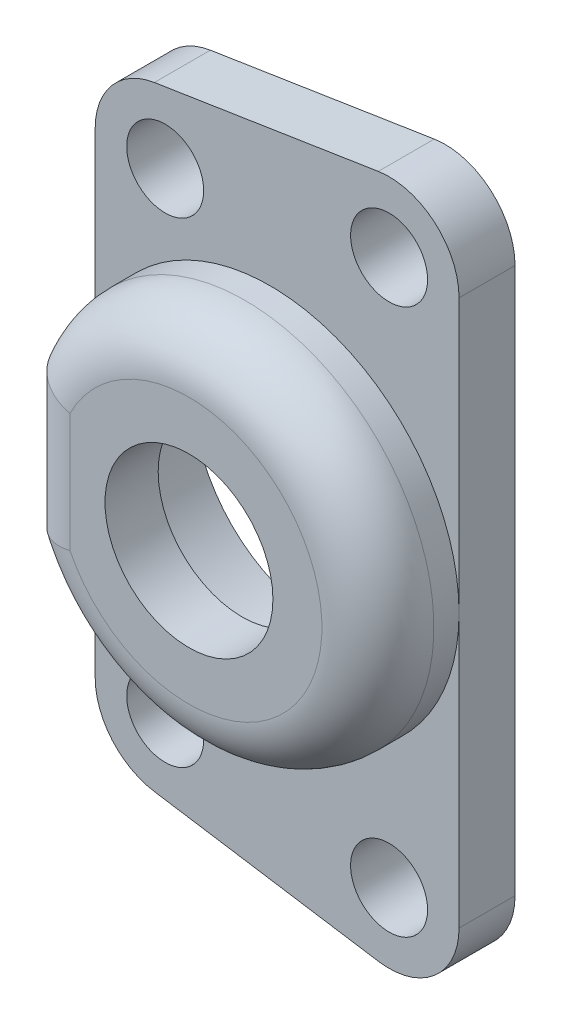
ISO-10303-21;
HEADER;
FILE_DESCRIPTION(('STEP AP214'),'2;1');
FILE_NAME('part.step','',(''),(''),'','','');
FILE_SCHEMA(('AUTOMOTIVE_DESIGN { 1 0 10303 214 1 1 1 1 }'));
ENDSEC;
DATA;
#1=APPLICATION_CONTEXT('core data for automotive mechanical design processes');
#2=APPLICATION_PROTOCOL_DEFINITION('international standard','automotive_design',2000,#1);
#3=PRODUCT_CONTEXT('',#1,'mechanical');
#4=PRODUCT('Part','Part','',(#3));
#5=PRODUCT_RELATED_PRODUCT_CATEGORY('part','',(#4));
#6=PRODUCT_DEFINITION_FORMATION('','',#4);
#7=PRODUCT_DEFINITION_CONTEXT('part definition',#1,'design');
#8=PRODUCT_DEFINITION('design','',#6,#7);
#9=PRODUCT_DEFINITION_SHAPE('','',#8);
#10=(LENGTH_UNIT() NAMED_UNIT(*) SI_UNIT(.MILLI.,.METRE.));
#11=(NAMED_UNIT(*) PLANE_ANGLE_UNIT() SI_UNIT($,.RADIAN.));
#12=(NAMED_UNIT(*) SI_UNIT($,.STERADIAN.) SOLID_ANGLE_UNIT());
#13=UNCERTAINTY_MEASURE_WITH_UNIT(LENGTH_MEASURE(1.E-05),#10,'distance_accuracy_value','');
#14=(GEOMETRIC_REPRESENTATION_CONTEXT(3) GLOBAL_UNCERTAINTY_ASSIGNED_CONTEXT((#13)) GLOBAL_UNIT_ASSIGNED_CONTEXT((#10,
#11,#12)) REPRESENTATION_CONTEXT('',''));
#15=CARTESIAN_POINT('',(0.,0.,0.));
#16=DIRECTION('',(0.,0.,1.));
#17=DIRECTION('',(1.,0.,0.));
#18=AXIS2_PLACEMENT_3D('',#15,#16,#17);
#19=CARTESIAN_POINT('',(7.50000000000001,17.,0.));
#20=DIRECTION('',(0.,0.,1.));
#21=DIRECTION('',(1.,0.,0.));
#22=AXIS2_PLACEMENT_3D('',#19,#20,#21);
#23=CYLINDRICAL_SURFACE('',#22,6.);
#24=CARTESIAN_POINT('',(7.50000000000001,17.,9.8));
#25=DIRECTION('',(0.,0.,1.));
#26=DIRECTION('',(1.,0.,0.));
#27=AXIS2_PLACEMENT_3D('',#24,#25,#26);
#28=CIRCLE('',#27,6.);
#29=CARTESIAN_POINT('',(13.5,17.,9.8));
#30=VERTEX_POINT('',#29);
#31=EDGE_CURVE('E181',#30,#30,#28,.T.);
#32=ORIENTED_EDGE('',*,*,#31,.T.);
#33=EDGE_LOOP('',(#32));
#34=FACE_BOUND('',#33,.T.);
#35=CARTESIAN_POINT('',(7.50000000000001,17.,6.));
#36=DIRECTION('',(0.,0.,-1.));
#37=DIRECTION('',(-1.,0.,0.));
#38=AXIS2_PLACEMENT_3D('',#35,#36,#37);
#39=CIRCLE('',#38,6.);
#40=CARTESIAN_POINT('',(1.5,17.,6.));
#41=VERTEX_POINT('',#40);
#42=EDGE_CURVE('E37',#41,#41,#39,.F.);
#43=ORIENTED_EDGE('',*,*,#42,.F.);
#44=EDGE_LOOP('',(#43));
#45=FACE_BOUND('',#44,.T.);
#46=ADVANCED_FACE('F33',(#34,#45),#23,.F.);
#47=CARTESIAN_POINT('',(16.,36.5,4.));
#48=DIRECTION('',(0.,0.,-1.));
#49=DIRECTION('',(-1.,0.,0.));
#50=AXIS2_PLACEMENT_3D('',#47,#48,#49);
#51=PLANE('',#50);
#52=CARTESIAN_POINT('',(0.,0.,4.));
#53=DIRECTION('',(0.,0.,1.));
#54=DIRECTION('',(1.,0.,0.));
#55=AXIS2_PLACEMENT_3D('',#52,#53,#54);
#56=CIRCLE('',#55,2.75);
#57=CARTESIAN_POINT('',(2.75000000000001,0.,4.));
#58=VERTEX_POINT('',#57);
#59=EDGE_CURVE('E240',#58,#58,#56,.T.);
#60=ORIENTED_EDGE('',*,*,#59,.F.);
#61=EDGE_LOOP('',(#60));
#62=FACE_BOUND('',#61,.T.);
#63=CARTESIAN_POINT('',(16.,-2.5,4.));
#64=DIRECTION('',(0.,0.,1.));
#65=DIRECTION('',(1.,0.,0.));
#66=AXIS2_PLACEMENT_3D('',#63,#64,#65);
#67=CIRCLE('',#66,2.75);
#68=CARTESIAN_POINT('',(18.75,-2.5,4.));
#69=VERTEX_POINT('',#68);
#70=EDGE_CURVE('E234',#69,#69,#67,.T.);
#71=ORIENTED_EDGE('',*,*,#70,.F.);
#72=EDGE_LOOP('',(#71));
#73=FACE_BOUND('',#72,.T.);
#74=CARTESIAN_POINT('',(7.50000000000001,17.,4.));
#75=DIRECTION('',(0.,0.,1.));
#76=DIRECTION('',(1.,0.,0.));
#77=AXIS2_PLACEMENT_3D('',#74,#75,#76);
#78=CIRCLE('',#77,13.5);
#79=CARTESIAN_POINT('',(-5.,11.9009804864072,4.));
#80=VERTEX_POINT('',#79);
#81=CARTESIAN_POINT('',(21.,17.,4.));
#82=VERTEX_POINT('',#81);
#83=EDGE_CURVE('E142',#80,#82,#78,.T.);
#84=ORIENTED_EDGE('',*,*,#83,.F.);
#85=DIRECTION('',(0.,-1.,0.));
#86=VECTOR('',#85,1.);
#87=CARTESIAN_POINT('',(-5.,0.,4.));
#88=LINE('',#87,#86);
#89=CARTESIAN_POINT('',(-5.,0.,4.));
#90=VERTEX_POINT('',#89);
#91=EDGE_CURVE('E137',#80,#90,#88,.T.);
#92=ORIENTED_EDGE('',*,*,#91,.T.);
#93=CARTESIAN_POINT('',(0.,0.,4.));
#94=DIRECTION('',(0.,0.,1.));
#95=DIRECTION('',(-1.,0.,0.));
#96=AXIS2_PLACEMENT_3D('',#93,#94,#95);
#97=CIRCLE('',#96,5.);
#98=CARTESIAN_POINT('',(-0.77188440136804,-4.94006016875551,4.));
#99=VERTEX_POINT('',#98);
#100=EDGE_CURVE('E136',#90,#99,#97,.T.);
#101=ORIENTED_EDGE('',*,*,#100,.T.);
#102=DIRECTION('',(0.988012033751101,-0.15437688027361,0.));
#103=VECTOR('',#102,1.);
#104=CARTESIAN_POINT('',(15.2281155986319,-7.4400601687555,4.));
#105=LINE('',#104,#103);
#106=CARTESIAN_POINT('',(15.2281155986319,-7.4400601687555,4.));
#107=VERTEX_POINT('',#106);
#108=EDGE_CURVE('E286',#99,#107,#105,.T.);
#109=ORIENTED_EDGE('',*,*,#108,.T.);
#110=CARTESIAN_POINT('',(16.,-2.5,4.));
#111=DIRECTION('',(0.,0.,1.));
#112=DIRECTION('',(-1.,0.,0.));
#113=AXIS2_PLACEMENT_3D('',#110,#111,#112);
#114=CIRCLE('',#113,5.);
#115=CARTESIAN_POINT('',(21.,-2.5,4.));
#116=VERTEX_POINT('',#115);
#117=EDGE_CURVE('E285',#107,#116,#114,.T.);
#118=ORIENTED_EDGE('',*,*,#117,.T.);
#119=DIRECTION('',(0.,1.,0.));
#120=VECTOR('',#119,1.);
#121=CARTESIAN_POINT('',(21.,36.5,4.));
#122=LINE('',#121,#120);
#123=EDGE_CURVE('E252',#116,#82,#122,.T.);
#124=ORIENTED_EDGE('',*,*,#123,.T.);
#125=EDGE_LOOP('',(#84,#92,#101,#109,#118,#124));
#126=FACE_BOUND('',#125,.T.);
#127=ADVANCED_FACE('F193',(#62,#73,#126),#51,.F.);
#128=CARTESIAN_POINT('',(16.,36.5,4.));
#129=DIRECTION('',(0.,0.,1.));
#130=DIRECTION('',(1.,0.,0.));
#131=AXIS2_PLACEMENT_3D('',#128,#129,#130);
#132=CIRCLE('',#131,2.75);
#133=CARTESIAN_POINT('',(18.75,36.5,4.));
#134=VERTEX_POINT('',#133);
#135=EDGE_CURVE('E228',#134,#134,#132,.T.);
#136=ORIENTED_EDGE('',*,*,#135,.F.);
#137=EDGE_LOOP('',(#136));
#138=FACE_BOUND('',#137,.T.);
#139=CARTESIAN_POINT('',(0.,34.,4.));
#140=DIRECTION('',(0.,0.,1.));
#141=DIRECTION('',(1.,0.,0.));
#142=AXIS2_PLACEMENT_3D('',#139,#140,#141);
#143=CIRCLE('',#142,2.75);
#144=CARTESIAN_POINT('',(2.75000000000001,34.,4.));
#145=VERTEX_POINT('',#144);
#146=EDGE_CURVE('E222',#145,#145,#143,.T.);
#147=ORIENTED_EDGE('',*,*,#146,.F.);
#148=EDGE_LOOP('',(#147));
#149=FACE_BOUND('',#148,.T.);
#150=CARTESIAN_POINT('',(-4.99999999999998,22.0990195135928,4.));
#151=VERTEX_POINT('',#150);
#152=EDGE_CURVE('E131',#82,#151,#78,.T.);
#153=ORIENTED_EDGE('',*,*,#152,.F.);
#154=CARTESIAN_POINT('',(21.,36.5,4.));
#155=VERTEX_POINT('',#154);
#156=EDGE_CURVE('E284',#82,#155,#122,.T.);
#157=ORIENTED_EDGE('',*,*,#156,.T.);
#158=CARTESIAN_POINT('',(16.,36.5,4.));
#159=DIRECTION('',(0.,0.,1.));
#160=DIRECTION('',(-1.,0.,0.));
#161=AXIS2_PLACEMENT_3D('',#158,#159,#160);
#162=CIRCLE('',#161,4.99999999999999);
#163=CARTESIAN_POINT('',(15.2281155986319,41.4400601687555,4.));
#164=VERTEX_POINT('',#163);
#165=EDGE_CURVE('E258',#155,#164,#162,.T.);
#166=ORIENTED_EDGE('',*,*,#165,.T.);
#167=DIRECTION('',(-0.988012033751101,-0.15437688027361,0.));
#168=VECTOR('',#167,1.);
#169=CARTESIAN_POINT('',(-0.771884401368045,38.9400601687555,4.));
#170=LINE('',#169,#168);
#171=CARTESIAN_POINT('',(-0.771884401368045,38.9400601687555,4.));
#172=VERTEX_POINT('',#171);
#173=EDGE_CURVE('E256',#164,#172,#170,.T.);
#174=ORIENTED_EDGE('',*,*,#173,.T.);
#175=CARTESIAN_POINT('',(0.,34.,4.));
#176=DIRECTION('',(0.,0.,1.));
#177=DIRECTION('',(-1.,0.,0.));
#178=AXIS2_PLACEMENT_3D('',#175,#176,#177);
#179=CIRCLE('',#178,5.);
#180=CARTESIAN_POINT('',(-5.,34.,4.));
#181=VERTEX_POINT('',#180);
#182=EDGE_CURVE('E134',#172,#181,#179,.T.);
#183=ORIENTED_EDGE('',*,*,#182,.T.);
#184=EDGE_CURVE('E122',#181,#151,#88,.T.);
#185=ORIENTED_EDGE('',*,*,#184,.T.);
#186=EDGE_LOOP('',(#153,#157,#166,#174,#183,#185));
#187=FACE_BOUND('',#186,.T.);
#188=ADVANCED_FACE('F130',(#138,#149,#187),#51,.F.);
#189=CARTESIAN_POINT('',(16.,36.5,4.));
#190=DIRECTION('',(0.,0.,-1.));
#191=DIRECTION('',(-1.,0.,0.));
#192=AXIS2_PLACEMENT_3D('',#189,#190,#191);
#193=CYLINDRICAL_SURFACE('',#192,4.99999999999999);
#194=CARTESIAN_POINT('',(16.,36.5,0.));
#195=DIRECTION('',(0.,0.,1.));
#196=DIRECTION('',(-1.,0.,0.));
#197=AXIS2_PLACEMENT_3D('',#194,#195,#196);
#198=CIRCLE('',#197,4.99999999999999);
#199=CARTESIAN_POINT('',(21.,36.5,0.));
#200=VERTEX_POINT('',#199);
#201=CARTESIAN_POINT('',(15.2281155986319,41.4400601687555,0.));
#202=VERTEX_POINT('',#201);
#203=EDGE_CURVE('E126',#200,#202,#198,.T.);
#204=ORIENTED_EDGE('',*,*,#203,.T.);
#205=DIRECTION('',(0.,0.,-1.));
#206=VECTOR('',#205,1.);
#207=CARTESIAN_POINT('',(15.2281155986319,41.4400601687555,4.));
#208=LINE('',#207,#206);
#209=EDGE_CURVE('E144',#164,#202,#208,.T.);
#210=ORIENTED_EDGE('',*,*,#209,.F.);
#211=ORIENTED_EDGE('',*,*,#165,.F.);
#212=DIRECTION('',(0.,0.,-1.));
#213=VECTOR('',#212,1.);
#214=CARTESIAN_POINT('',(21.,36.5,4.));
#215=LINE('',#214,#213);
#216=EDGE_CURVE('E280',#155,#200,#215,.T.);
#217=ORIENTED_EDGE('',*,*,#216,.T.);
#218=EDGE_LOOP('',(#204,#210,#211,#217));
#219=FACE_BOUND('',#218,.T.);
#220=ADVANCED_FACE('F35',(#219),#193,.T.);
#221=CARTESIAN_POINT('',(-0.771884401368045,38.9400601687555,4.));
#222=DIRECTION('',(0.15437688027361,-0.988012033751101,0.));
#223=DIRECTION('',(0.988012033751101,0.15437688027361,0.));
#224=AXIS2_PLACEMENT_3D('',#221,#222,#223);
#225=PLANE('',#224);
#226=DIRECTION('',(-0.988012033751101,-0.15437688027361,0.));
#227=VECTOR('',#226,1.);
#228=CARTESIAN_POINT('',(-0.771884401368045,38.9400601687555,0.));
#229=LINE('',#228,#227);
#230=CARTESIAN_POINT('',(-0.771884401368045,38.9400601687555,0.));
#231=VERTEX_POINT('',#230);
#232=EDGE_CURVE('E318',#202,#231,#229,.T.);
#233=ORIENTED_EDGE('',*,*,#232,.T.);
#234=DIRECTION('',(0.,0.,-1.));
#235=VECTOR('',#234,1.);
#236=CARTESIAN_POINT('',(-0.771884401368045,38.9400601687555,4.));
#237=LINE('',#236,#235);
#238=EDGE_CURVE('E149',#172,#231,#237,.T.);
#239=ORIENTED_EDGE('',*,*,#238,.F.);
#240=ORIENTED_EDGE('',*,*,#173,.F.);
#241=ORIENTED_EDGE('',*,*,#209,.T.);
#242=EDGE_LOOP('',(#233,#239,#240,#241));
#243=FACE_BOUND('',#242,.T.);
#244=ADVANCED_FACE('F317',(#243),#225,.F.);
#245=CARTESIAN_POINT('',(0.,34.,4.));
#246=DIRECTION('',(0.,0.,-1.));
#247=DIRECTION('',(-1.,0.,0.));
#248=AXIS2_PLACEMENT_3D('',#245,#246,#247);
#249=CYLINDRICAL_SURFACE('',#248,5.);
#250=CARTESIAN_POINT('',(0.,34.,0.));
#251=DIRECTION('',(0.,0.,1.));
#252=DIRECTION('',(-1.,0.,0.));
#253=AXIS2_PLACEMENT_3D('',#250,#251,#252);
#254=CIRCLE('',#253,5.);
#255=CARTESIAN_POINT('',(-5.,34.,0.));
#256=VERTEX_POINT('',#255);
#257=EDGE_CURVE('E322',#231,#256,#254,.T.);
#258=ORIENTED_EDGE('',*,*,#257,.T.);
#259=DIRECTION('',(0.,0.,-1.));
#260=VECTOR('',#259,1.);
#261=CARTESIAN_POINT('',(-5.,34.,4.));
#262=LINE('',#261,#260);
#263=EDGE_CURVE('E268',#181,#256,#262,.T.);
#264=ORIENTED_EDGE('',*,*,#263,.F.);
#265=ORIENTED_EDGE('',*,*,#182,.F.);
#266=ORIENTED_EDGE('',*,*,#238,.T.);
#267=EDGE_LOOP('',(#258,#264,#265,#266));
#268=FACE_BOUND('',#267,.T.);
#269=ADVANCED_FACE('F321',(#268),#249,.T.);
#270=CARTESIAN_POINT('',(-5.,0.,4.));
#271=DIRECTION('',(1.,0.,0.));
#272=DIRECTION('',(0.,0.,-1.));
#273=AXIS2_PLACEMENT_3D('',#270,#271,#272);
#274=PLANE('',#273);
#275=DIRECTION('',(0.,0.,-1.));
#276=VECTOR('',#275,1.);
#277=CARTESIAN_POINT('',(-4.99999999999998,11.9009804864072,9.8));
#278=LINE('',#277,#276);
#279=CARTESIAN_POINT('',(-4.99999999999998,11.9009804864072,5.8));
#280=VERTEX_POINT('',#279);
#281=EDGE_CURVE('E127',#280,#80,#278,.T.);
#282=ORIENTED_EDGE('',*,*,#281,.F.);
#283=DIRECTION('',(0.,-1.,0.));
#284=VECTOR('',#283,1.);
#285=CARTESIAN_POINT('',(-5.,22.0990195135928,5.8));
#286=LINE('',#285,#284);
#287=CARTESIAN_POINT('',(-4.99999999999998,22.0990195135928,5.8));
#288=VERTEX_POINT('',#287);
#289=EDGE_CURVE('E11',#280,#288,#286,.F.);
#290=ORIENTED_EDGE('',*,*,#289,.T.);
#291=DIRECTION('',(0.,0.,-1.));
#292=VECTOR('',#291,1.);
#293=CARTESIAN_POINT('',(-4.99999999999998,22.0990195135928,9.8));
#294=LINE('',#293,#292);
#295=EDGE_CURVE('E118',#288,#151,#294,.T.);
#296=ORIENTED_EDGE('',*,*,#295,.T.);
#297=ORIENTED_EDGE('',*,*,#184,.F.);
#298=ORIENTED_EDGE('',*,*,#263,.T.);
#299=DIRECTION('',(0.,-1.,0.));
#300=VECTOR('',#299,1.);
#301=CARTESIAN_POINT('',(-5.,0.,0.));
#302=LINE('',#301,#300);
#303=CARTESIAN_POINT('',(-5.,0.,0.));
#304=VERTEX_POINT('',#303);
#305=EDGE_CURVE('E324',#256,#304,#302,.T.);
#306=ORIENTED_EDGE('',*,*,#305,.T.);
#307=DIRECTION('',(0.,0.,-1.));
#308=VECTOR('',#307,1.);
#309=CARTESIAN_POINT('',(-5.,0.,4.));
#310=LINE('',#309,#308);
#311=EDGE_CURVE('E254',#90,#304,#310,.T.);
#312=ORIENTED_EDGE('',*,*,#311,.F.);
#313=ORIENTED_EDGE('',*,*,#91,.F.);
#314=EDGE_LOOP('',(#282,#290,#296,#297,#298,#306,#312,#313));
#315=FACE_BOUND('',#314,.T.);
#316=ADVANCED_FACE('F120',(#315),#274,.F.);
#317=CARTESIAN_POINT('',(0.,0.,4.));
#318=DIRECTION('',(0.,0.,-1.));
#319=DIRECTION('',(-1.,0.,0.));
#320=AXIS2_PLACEMENT_3D('',#317,#318,#319);
#321=CYLINDRICAL_SURFACE('',#320,5.);
#322=CARTESIAN_POINT('',(0.,0.,0.));
#323=DIRECTION('',(0.,0.,1.));
#324=DIRECTION('',(-1.,0.,0.));
#325=AXIS2_PLACEMENT_3D('',#322,#323,#324);
#326=CIRCLE('',#325,5.);
#327=CARTESIAN_POINT('',(-0.77188440136804,-4.94006016875551,0.));
#328=VERTEX_POINT('',#327);
#329=EDGE_CURVE('E293',#304,#328,#326,.T.);
#330=ORIENTED_EDGE('',*,*,#329,.T.);
#331=DIRECTION('',(0.,0.,-1.));
#332=VECTOR('',#331,1.);
#333=CARTESIAN_POINT('',(-0.77188440136804,-4.94006016875551,4.));
#334=LINE('',#333,#332);
#335=EDGE_CURVE('E271',#99,#328,#334,.T.);
#336=ORIENTED_EDGE('',*,*,#335,.F.);
#337=ORIENTED_EDGE('',*,*,#100,.F.);
#338=ORIENTED_EDGE('',*,*,#311,.T.);
#339=EDGE_LOOP('',(#330,#336,#337,#338));
#340=FACE_BOUND('',#339,.T.);
#341=ADVANCED_FACE('F291',(#340),#321,.T.);
#342=CARTESIAN_POINT('',(15.2281155986319,-7.4400601687555,4.));
#343=DIRECTION('',(0.15437688027361,0.988012033751101,0.));
#344=DIRECTION('',(-0.988012033751101,0.15437688027361,0.));
#345=AXIS2_PLACEMENT_3D('',#342,#343,#344);
#346=PLANE('',#345);
#347=DIRECTION('',(0.988012033751101,-0.15437688027361,0.));
#348=VECTOR('',#347,1.);
#349=CARTESIAN_POINT('',(15.2281155986319,-7.4400601687555,0.));
#350=LINE('',#349,#348);
#351=CARTESIAN_POINT('',(15.2281155986319,-7.4400601687555,0.));
#352=VERTEX_POINT('',#351);
#353=EDGE_CURVE('E298',#328,#352,#350,.T.);
#354=ORIENTED_EDGE('',*,*,#353,.T.);
#355=DIRECTION('',(0.,0.,-1.));
#356=VECTOR('',#355,1.);
#357=CARTESIAN_POINT('',(15.2281155986319,-7.4400601687555,4.));
#358=LINE('',#357,#356);
#359=EDGE_CURVE('E274',#107,#352,#358,.T.);
#360=ORIENTED_EDGE('',*,*,#359,.F.);
#361=ORIENTED_EDGE('',*,*,#108,.F.);
#362=ORIENTED_EDGE('',*,*,#335,.T.);
#363=EDGE_LOOP('',(#354,#360,#361,#362));
#364=FACE_BOUND('',#363,.T.);
#365=ADVANCED_FACE('F296',(#364),#346,.F.);
#366=CARTESIAN_POINT('',(16.,-2.5,4.));
#367=DIRECTION('',(0.,0.,-1.));
#368=DIRECTION('',(-1.,0.,0.));
#369=AXIS2_PLACEMENT_3D('',#366,#367,#368);
#370=CYLINDRICAL_SURFACE('',#369,5.);
#371=CARTESIAN_POINT('',(16.,-2.5,0.));
#372=DIRECTION('',(0.,0.,1.));
#373=DIRECTION('',(-1.,0.,0.));
#374=AXIS2_PLACEMENT_3D('',#371,#372,#373);
#375=CIRCLE('',#374,5.);
#376=CARTESIAN_POINT('',(21.,-2.5,0.));
#377=VERTEX_POINT('',#376);
#378=EDGE_CURVE('E303',#352,#377,#375,.T.);
#379=ORIENTED_EDGE('',*,*,#378,.T.);
#380=DIRECTION('',(0.,0.,-1.));
#381=VECTOR('',#380,1.);
#382=CARTESIAN_POINT('',(21.,-2.5,4.));
#383=LINE('',#382,#381);
#384=EDGE_CURVE('E277',#116,#377,#383,.T.);
#385=ORIENTED_EDGE('',*,*,#384,.F.);
#386=ORIENTED_EDGE('',*,*,#117,.F.);
#387=ORIENTED_EDGE('',*,*,#359,.T.);
#388=EDGE_LOOP('',(#379,#385,#386,#387));
#389=FACE_BOUND('',#388,.T.);
#390=ADVANCED_FACE('F302',(#389),#370,.T.);
#391=CARTESIAN_POINT('',(21.,36.5,4.));
#392=DIRECTION('',(-1.,0.,0.));
#393=DIRECTION('',(0.,0.,1.));
#394=AXIS2_PLACEMENT_3D('',#391,#392,#393);
#395=PLANE('',#394);
#396=DIRECTION('',(0.,1.,0.));
#397=VECTOR('',#396,1.);
#398=CARTESIAN_POINT('',(21.,36.5,0.));
#399=LINE('',#398,#397);
#400=EDGE_CURVE('E313',#377,#200,#399,.T.);
#401=ORIENTED_EDGE('',*,*,#400,.T.);
#402=ORIENTED_EDGE('',*,*,#216,.F.);
#403=ORIENTED_EDGE('',*,*,#156,.F.);
#404=ORIENTED_EDGE('',*,*,#123,.F.);
#405=ORIENTED_EDGE('',*,*,#384,.T.);
#406=EDGE_LOOP('',(#401,#402,#403,#404,#405));
#407=FACE_BOUND('',#406,.T.);
#408=ADVANCED_FACE('F306',(#407),#395,.F.);
#409=CARTESIAN_POINT('',(16.,36.5,0.));
#410=DIRECTION('',(0.,0.,-1.));
#411=DIRECTION('',(-1.,0.,0.));
#412=AXIS2_PLACEMENT_3D('',#409,#410,#411);
#413=PLANE('',#412);
#414=CARTESIAN_POINT('',(0.,0.,0.));
#415=DIRECTION('',(0.,0.,1.));
#416=DIRECTION('',(1.,0.,0.));
#417=AXIS2_PLACEMENT_3D('',#414,#415,#416);
#418=CIRCLE('',#417,2.75);
#419=CARTESIAN_POINT('',(2.75000000000001,0.,0.));
#420=VERTEX_POINT('',#419);
#421=EDGE_CURVE('E237',#420,#420,#418,.T.);
#422=ORIENTED_EDGE('',*,*,#421,.T.);
#423=EDGE_LOOP('',(#422));
#424=FACE_BOUND('',#423,.T.);
#425=CARTESIAN_POINT('',(16.,-2.5,0.));
#426=DIRECTION('',(0.,0.,1.));
#427=DIRECTION('',(1.,0.,0.));
#428=AXIS2_PLACEMENT_3D('',#425,#426,#427);
#429=CIRCLE('',#428,2.75);
#430=CARTESIAN_POINT('',(18.75,-2.5,0.));
#431=VERTEX_POINT('',#430);
#432=EDGE_CURVE('E231',#431,#431,#429,.T.);
#433=ORIENTED_EDGE('',*,*,#432,.T.);
#434=EDGE_LOOP('',(#433));
#435=FACE_BOUND('',#434,.T.);
#436=CARTESIAN_POINT('',(16.,36.5,0.));
#437=DIRECTION('',(0.,0.,1.));
#438=DIRECTION('',(1.,0.,0.));
#439=AXIS2_PLACEMENT_3D('',#436,#437,#438);
#440=CIRCLE('',#439,2.75);
#441=CARTESIAN_POINT('',(18.75,36.5,0.));
#442=VERTEX_POINT('',#441);
#443=EDGE_CURVE('E225',#442,#442,#440,.T.);
#444=ORIENTED_EDGE('',*,*,#443,.T.);
#445=EDGE_LOOP('',(#444));
#446=FACE_BOUND('',#445,.T.);
#447=CARTESIAN_POINT('',(0.,34.,0.));
#448=DIRECTION('',(0.,0.,1.));
#449=DIRECTION('',(1.,0.,0.));
#450=AXIS2_PLACEMENT_3D('',#447,#448,#449);
#451=CIRCLE('',#450,2.75);
#452=CARTESIAN_POINT('',(2.75000000000001,34.,0.));
#453=VERTEX_POINT('',#452);
#454=EDGE_CURVE('E219',#453,#453,#451,.T.);
#455=ORIENTED_EDGE('',*,*,#454,.T.);
#456=EDGE_LOOP('',(#455));
#457=FACE_BOUND('',#456,.T.);
#458=CARTESIAN_POINT('',(7.50000000000001,17.,0.));
#459=DIRECTION('',(0.,0.,-1.));
#460=DIRECTION('',(-1.,0.,0.));
#461=AXIS2_PLACEMENT_3D('',#458,#459,#460);
#462=CIRCLE('',#461,9.5);
#463=CARTESIAN_POINT('',(-1.99999999999999,17.,0.));
#464=VERTEX_POINT('',#463);
#465=EDGE_CURVE('E216',#464,#464,#462,.T.);
#466=ORIENTED_EDGE('',*,*,#465,.F.);
#467=EDGE_LOOP('',(#466));
#468=FACE_BOUND('',#467,.T.);
#469=ORIENTED_EDGE('',*,*,#203,.F.);
#470=ORIENTED_EDGE('',*,*,#400,.F.);
#471=ORIENTED_EDGE('',*,*,#378,.F.);
#472=ORIENTED_EDGE('',*,*,#353,.F.);
#473=ORIENTED_EDGE('',*,*,#329,.F.);
#474=ORIENTED_EDGE('',*,*,#305,.F.);
#475=ORIENTED_EDGE('',*,*,#257,.F.);
#476=ORIENTED_EDGE('',*,*,#232,.F.);
#477=EDGE_LOOP('',(#469,#470,#471,#472,#473,#474,#475,#476));
#478=FACE_BOUND('',#477,.T.);
#479=ADVANCED_FACE('F326',(#424,#435,#446,#457,#468,#478),#413,.T.);
#480=CARTESIAN_POINT('',(7.50000000000001,17.,9.8));
#481=DIRECTION('',(0.,0.,-1.));
#482=DIRECTION('',(-1.,0.,0.));
#483=AXIS2_PLACEMENT_3D('',#480,#481,#482);
#484=CYLINDRICAL_SURFACE('',#483,13.5);
#485=ORIENTED_EDGE('',*,*,#295,.F.);
#486=CARTESIAN_POINT('',(7.50000000000001,17.,5.8));
#487=DIRECTION('',(0.,0.,1.));
#488=DIRECTION('',(1.,0.,0.));
#489=AXIS2_PLACEMENT_3D('',#486,#487,#488);
#490=CIRCLE('',#489,13.5);
#491=EDGE_CURVE('E42',#288,#280,#490,.F.);
#492=ORIENTED_EDGE('',*,*,#491,.T.);
#493=ORIENTED_EDGE('',*,*,#281,.T.);
#494=ORIENTED_EDGE('',*,*,#83,.T.);
#495=ORIENTED_EDGE('',*,*,#152,.T.);
#496=EDGE_LOOP('',(#485,#492,#493,#494,#495));
#497=FACE_BOUND('',#496,.T.);
#498=ADVANCED_FACE('F140',(#497),#484,.T.);
#499=CARTESIAN_POINT('',(7.50000000000001,17.,9.8));
#500=DIRECTION('',(0.,0.,1.));
#501=DIRECTION('',(1.,0.,0.));
#502=AXIS2_PLACEMENT_3D('',#499,#500,#501);
#503=PLANE('',#502);
#504=ORIENTED_EDGE('',*,*,#31,.F.);
#505=EDGE_LOOP('',(#504));
#506=FACE_BOUND('',#505,.T.);
#507=DIRECTION('',(0.,-1.,0.));
#508=VECTOR('',#507,1.);
#509=CARTESIAN_POINT('',(-0.999999999999997,11.9009804864072,9.8));
#510=LINE('',#509,#508);
#511=CARTESIAN_POINT('',(-0.999999999999997,21.2426406871193,9.8));
#512=VERTEX_POINT('',#511);
#513=CARTESIAN_POINT('',(-0.999999999999997,12.7573593128807,9.8));
#514=VERTEX_POINT('',#513);
#515=EDGE_CURVE('E143',#512,#514,#510,.T.);
#516=ORIENTED_EDGE('',*,*,#515,.T.);
#517=CARTESIAN_POINT('',(7.50000000000001,17.,9.8));
#518=DIRECTION('',(0.,0.,1.));
#519=DIRECTION('',(1.,0.,0.));
#520=AXIS2_PLACEMENT_3D('',#517,#518,#519);
#521=CIRCLE('',#520,9.5);
#522=EDGE_CURVE('E146',#514,#512,#521,.T.);
#523=ORIENTED_EDGE('',*,*,#522,.T.);
#524=EDGE_LOOP('',(#516,#523));
#525=FACE_BOUND('',#524,.T.);
#526=ADVANCED_FACE('F175',(#506,#525),#503,.T.);
#527=CARTESIAN_POINT('',(-0.999999999999997,17.,5.8));
#528=DIRECTION('',(0.,1.,0.));
#529=DIRECTION('',(0.,0.,1.));
#530=AXIS2_PLACEMENT_3D('',#527,#528,#529);
#531=CYLINDRICAL_SURFACE('',#530,4.);
#532=CARTESIAN_POINT('',(-4.99999999999998,22.0990195135928,5.8));
#533=CARTESIAN_POINT('',(-5.00001302593747,22.0990210436756,5.91090455653621));
#534=CARTESIAN_POINT('',(-4.99538808486331,22.0981150091083,6.02180651776563));
#535=CARTESIAN_POINT('',(-4.97695719512908,22.094499038416,6.24280670895802));
#536=CARTESIAN_POINT('',(-4.96315198264311,22.091789246936,6.35290500265215));
#537=CARTESIAN_POINT('',(-4.92647680825317,22.0845811848724,6.5713901088685));
#538=CARTESIAN_POINT('',(-4.90361741767363,22.0800849999969,6.67977876458326));
#539=CARTESIAN_POINT('',(-4.84902044182661,22.0693263838395,6.89420356042425));
#540=CARTESIAN_POINT('',(-4.81728291101228,22.0630639633905,7.00023971497501));
#541=CARTESIAN_POINT('',(-4.74516694369879,22.0488003265829,7.20923383225195));
#542=CARTESIAN_POINT('',(-4.70478741542803,22.0407988905267,7.31219140417603));
#543=CARTESIAN_POINT('',(-4.61571254422248,22.0230969673635,7.51430520304458));
#544=CARTESIAN_POINT('',(-4.56701413651033,22.0133958540405,7.61346001245979));
#545=CARTESIAN_POINT('',(-4.40901272308739,21.98181402775,7.90407351649012));
#546=CARTESIAN_POINT('',(-4.28771826209092,21.9574380909749,8.08892717479529));
#547=CARTESIAN_POINT('',(-4.01603068210499,21.9023284268353,8.43679641719952));
#548=CARTESIAN_POINT('',(-3.86543226965956,21.8715497321966,8.59964332759341));
#549=CARTESIAN_POINT('',(-3.54009886628625,21.804302919778,8.89783351634407));
#550=CARTESIAN_POINT('',(-3.36535659444869,21.7678330853264,9.03316846755512));
#551=CARTESIAN_POINT('',(-2.99354419942567,21.6892068125079,9.27503548875084));
#552=CARTESIAN_POINT('',(-2.79613097235854,21.6469604260844,9.38100982866301));
#553=CARTESIAN_POINT('',(-2.38727271564901,21.558125926356,9.55833217195182));
#554=CARTESIAN_POINT('',(-2.1758330246358,21.5115394622343,9.62969326453396));
#555=CARTESIAN_POINT('',(-1.80601724557368,21.4286833514463,9.72118783092738));
#556=CARTESIAN_POINT('',(-1.64955614940552,21.3932246263707,9.75010315651569));
#557=CARTESIAN_POINT('',(-1.33479539677202,21.3209825206184,9.78910664504625));
#558=CARTESIAN_POINT('',(-1.17649955596386,21.2842016387937,9.79922859785329));
#559=CARTESIAN_POINT('',(-1.01228205186437,21.2455348575144,9.79998589312859));
#560=CARTESIAN_POINT('',(-1.00614082251814,21.2440880968467,9.80000003670149));
#561=CARTESIAN_POINT('',(-0.999999999999997,21.2426406871193,9.8));
#562=B_SPLINE_CURVE_WITH_KNOTS('',3,(#532,#533,#534,#535,#536,#537,#538,#539,#540,#541,#542,
#543,#544,#545,#546,#547,#548,#549,#550,#551,#552,#553,#554,#555,#556,#557,#558,#559,#560,#561),
.UNSPECIFIED.,.F.,.F.,(4,2,2,2,2,2,2,2,2,2,2,2,2,2,4),(0.,0.332609671786121,0.665192674523391,
0.997388504891177,1.32958229781514,1.66181808265811,1.99417653226705,2.65812082225914,
3.32689580015638,3.99587289823436,4.6768007419043,5.35747088751419,5.84553184031027,
6.3327144226512,6.35164242414854),.UNSPECIFIED.);
#563=EDGE_CURVE('E179',#288,#512,#562,.T.);
#564=ORIENTED_EDGE('',*,*,#563,.F.);
#565=ORIENTED_EDGE('',*,*,#289,.F.);
#566=CARTESIAN_POINT('',(-4.99999999999998,11.9009804864072,5.8));
#567=CARTESIAN_POINT('',(-5.00001302593747,11.9009789563244,5.91090455653621));
#568=CARTESIAN_POINT('',(-4.99538808486331,11.9018849908917,6.02180651776563));
#569=CARTESIAN_POINT('',(-4.97695719512908,11.905500961584,6.24280670895802));
#570=CARTESIAN_POINT('',(-4.96315198264311,11.908210753064,6.35290500265215));
#571=CARTESIAN_POINT('',(-4.92647680825317,11.9154188151276,6.5713901088685));
#572=CARTESIAN_POINT('',(-4.90361741767363,11.9199150000031,6.67977876458326));
#573=CARTESIAN_POINT('',(-4.84902044182661,11.9306736161605,6.89420356042425));
#574=CARTESIAN_POINT('',(-4.81728291101228,11.9369360366095,7.00023971497501));
#575=CARTESIAN_POINT('',(-4.74516694369879,11.9511996734171,7.20923383225195));
#576=CARTESIAN_POINT('',(-4.70478741542803,11.9592011094733,7.31219140417603));
#577=CARTESIAN_POINT('',(-4.61571254422248,11.9769030326365,7.51430520304458));
#578=CARTESIAN_POINT('',(-4.56701413651033,11.9866041459595,7.61346001245979));
#579=CARTESIAN_POINT('',(-4.40901272308739,12.01818597225,7.90407351649012));
#580=CARTESIAN_POINT('',(-4.28771826209092,12.0425619090251,8.08892717479529));
#581=CARTESIAN_POINT('',(-4.01603068210498,12.0976715731647,8.43679641719952));
#582=CARTESIAN_POINT('',(-3.86543226965956,12.1284502678034,8.59964332759341));
#583=CARTESIAN_POINT('',(-3.54009886628624,12.195697080222,8.89783351634407));
#584=CARTESIAN_POINT('',(-3.36535659444868,12.2321669146736,9.03316846755512));
#585=CARTESIAN_POINT('',(-2.99354419942568,12.3107931874921,9.27503548875084));
#586=CARTESIAN_POINT('',(-2.79613097235857,12.3530395739157,9.381009828663));
#587=CARTESIAN_POINT('',(-2.387272715649,12.4418740736439,9.55833217195181));
#588=CARTESIAN_POINT('',(-2.17583302463572,12.4884605377653,9.62969326453396));
#589=CARTESIAN_POINT('',(-1.80601724557374,12.571316648554,9.72118783092738));
#590=CARTESIAN_POINT('',(-1.64955614940572,12.6067753736302,9.75010315651569));
#591=CARTESIAN_POINT('',(-1.3347953967718,12.6790174793807,9.78910664504625));
#592=CARTESIAN_POINT('',(-1.17649955596307,12.715798361203,9.79922859785329));
#593=CARTESIAN_POINT('',(-1.01228205186431,12.7544651424854,9.79998589312859));
#594=CARTESIAN_POINT('',(-1.00614082251811,12.7559119031532,9.80000003670149));
#595=CARTESIAN_POINT('',(-0.999999999999997,12.7573593128807,9.8));
#596=B_SPLINE_CURVE_WITH_KNOTS('',3,(#566,#567,#568,#569,#570,#571,#572,#573,#574,#575,#576,
#577,#578,#579,#580,#581,#582,#583,#584,#585,#586,#587,#588,#589,#590,#591,#592,#593,#594,#595),
.UNSPECIFIED.,.F.,.F.,(4,2,2,2,2,2,2,2,2,2,2,2,2,2,4),(0.,0.332609671786121,0.665192674523391,
0.997388504891178,1.32958229781514,1.66181808265811,1.99417653226705,2.65812082225914,
3.32689580015638,3.99587289823436,4.67680074190427,5.3574708875142,5.84553184031029,
6.3327144226512,6.35164242414854),.UNSPECIFIED.);
#597=EDGE_CURVE('E49',#514,#280,#596,.F.);
#598=ORIENTED_EDGE('',*,*,#597,.F.);
#599=ORIENTED_EDGE('',*,*,#515,.F.);
#600=EDGE_LOOP('',(#564,#565,#598,#599));
#601=FACE_BOUND('',#600,.T.);
#602=ADVANCED_FACE('F182',(#601),#531,.T.);
#603=CARTESIAN_POINT('',(7.50000000000001,17.,5.8));
#604=DIRECTION('',(0.,0.,1.));
#605=DIRECTION('',(1.,0.,0.));
#606=AXIS2_PLACEMENT_3D('',#603,#604,#605);
#607=TOROIDAL_SURFACE('',#606,9.5,4.);
#608=ORIENTED_EDGE('',*,*,#597,.T.);
#609=ORIENTED_EDGE('',*,*,#491,.F.);
#610=ORIENTED_EDGE('',*,*,#563,.T.);
#611=ORIENTED_EDGE('',*,*,#522,.F.);
#612=EDGE_LOOP('',(#608,#609,#610,#611));
#613=FACE_BOUND('',#612,.T.);
#614=ADVANCED_FACE('F177',(#613),#607,.T.);
#615=CARTESIAN_POINT('',(7.50000000000001,17.,6.));
#616=DIRECTION('',(0.,0.,-1.));
#617=DIRECTION('',(-1.,0.,0.));
#618=AXIS2_PLACEMENT_3D('',#615,#616,#617);
#619=PLANE('',#618);
#620=CARTESIAN_POINT('',(7.50000000000001,17.,6.));
#621=DIRECTION('',(0.,0.,-1.));
#622=DIRECTION('',(-1.,0.,0.));
#623=AXIS2_PLACEMENT_3D('',#620,#621,#622);
#624=CIRCLE('',#623,9.5);
#625=CARTESIAN_POINT('',(-1.99999999999999,17.,6.));
#626=VERTEX_POINT('',#625);
#627=EDGE_CURVE('E213',#626,#626,#624,.T.);
#628=ORIENTED_EDGE('',*,*,#627,.T.);
#629=EDGE_LOOP('',(#628));
#630=FACE_BOUND('',#629,.T.);
#631=ORIENTED_EDGE('',*,*,#42,.T.);
#632=EDGE_LOOP('',(#631));
#633=FACE_BOUND('',#632,.T.);
#634=ADVANCED_FACE('F188',(#630,#633),#619,.T.);
#635=CARTESIAN_POINT('',(7.50000000000001,17.,6.));
#636=DIRECTION('',(0.,0.,-1.));
#637=DIRECTION('',(-1.,0.,0.));
#638=AXIS2_PLACEMENT_3D('',#635,#636,#637);
#639=CYLINDRICAL_SURFACE('',#638,9.5);
#640=ORIENTED_EDGE('',*,*,#627,.F.);
#641=EDGE_LOOP('',(#640));
#642=FACE_BOUND('',#641,.T.);
#643=ORIENTED_EDGE('',*,*,#465,.T.);
#644=EDGE_LOOP('',(#643));
#645=FACE_BOUND('',#644,.T.);
#646=ADVANCED_FACE('F204',(#642,#645),#639,.F.);
#647=CARTESIAN_POINT('',(0.,34.,0.));
#648=DIRECTION('',(0.,0.,1.));
#649=DIRECTION('',(1.,0.,0.));
#650=AXIS2_PLACEMENT_3D('',#647,#648,#649);
#651=CYLINDRICAL_SURFACE('',#650,2.75);
#652=ORIENTED_EDGE('',*,*,#454,.F.);
#653=EDGE_LOOP('',(#652));
#654=FACE_BOUND('',#653,.T.);
#655=ORIENTED_EDGE('',*,*,#146,.T.);
#656=EDGE_LOOP('',(#655));
#657=FACE_BOUND('',#656,.T.);
#658=ADVANCED_FACE('F367',(#654,#657),#651,.F.);
#659=CARTESIAN_POINT('',(16.,36.5,0.));
#660=DIRECTION('',(0.,0.,1.));
#661=DIRECTION('',(1.,0.,0.));
#662=AXIS2_PLACEMENT_3D('',#659,#660,#661);
#663=CYLINDRICAL_SURFACE('',#662,2.75);
#664=ORIENTED_EDGE('',*,*,#443,.F.);
#665=EDGE_LOOP('',(#664));
#666=FACE_BOUND('',#665,.T.);
#667=ORIENTED_EDGE('',*,*,#135,.T.);
#668=EDGE_LOOP('',(#667));
#669=FACE_BOUND('',#668,.T.);
#670=ADVANCED_FACE('F369',(#666,#669),#663,.F.);
#671=CARTESIAN_POINT('',(16.,-2.5,0.));
#672=DIRECTION('',(0.,0.,1.));
#673=DIRECTION('',(1.,0.,0.));
#674=AXIS2_PLACEMENT_3D('',#671,#672,#673);
#675=CYLINDRICAL_SURFACE('',#674,2.75);
#676=ORIENTED_EDGE('',*,*,#432,.F.);
#677=EDGE_LOOP('',(#676));
#678=FACE_BOUND('',#677,.T.);
#679=ORIENTED_EDGE('',*,*,#70,.T.);
#680=EDGE_LOOP('',(#679));
#681=FACE_BOUND('',#680,.T.);
#682=ADVANCED_FACE('F376',(#678,#681),#675,.F.);
#683=CARTESIAN_POINT('',(0.,0.,0.));
#684=DIRECTION('',(0.,0.,1.));
#685=DIRECTION('',(1.,0.,0.));
#686=AXIS2_PLACEMENT_3D('',#683,#684,#685);
#687=CYLINDRICAL_SURFACE('',#686,2.75);
#688=ORIENTED_EDGE('',*,*,#421,.F.);
#689=EDGE_LOOP('',(#688));
#690=FACE_BOUND('',#689,.T.);
#691=ORIENTED_EDGE('',*,*,#59,.T.);
#692=EDGE_LOOP('',(#691));
#693=FACE_BOUND('',#692,.T.);
#694=ADVANCED_FACE('F244',(#690,#693),#687,.F.);
#695=CLOSED_SHELL('',(#46,#127,#188,#220,#244,#269,#316,#341,#365,#390,#408,#479,#498,#526,#602,
#614,#634,#646,#658,#670,#682,#694));
#696=MANIFOLD_SOLID_BREP('B2',#695);
#697=ADVANCED_BREP_SHAPE_REPRESENTATION('',(#18,#696),#14);
#698=SHAPE_DEFINITION_REPRESENTATION(#9,#697);
ENDSEC;
END-ISO-10303-21;
